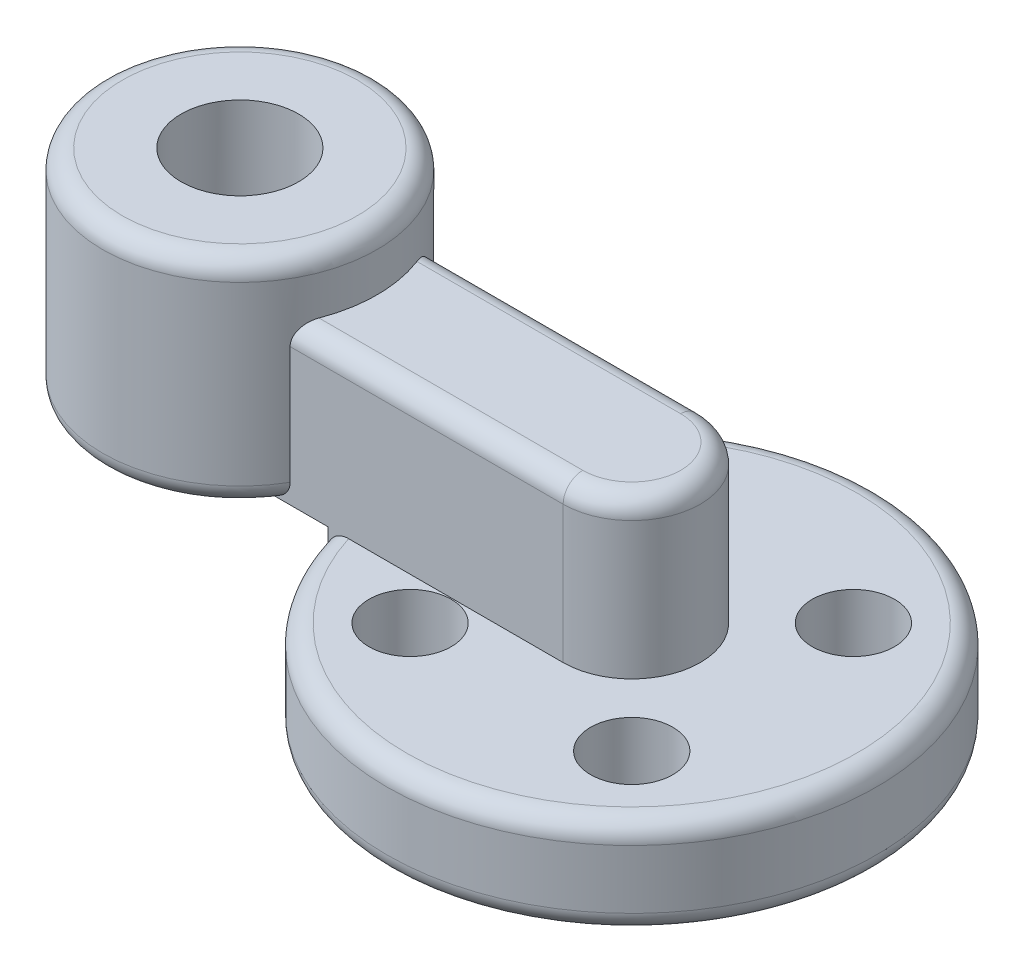
ISO-10303-21;
HEADER;
FILE_DESCRIPTION(('STEP AP214'),'2;1');
FILE_NAME('part.step','',(''),(''),'','','');
FILE_SCHEMA(('AUTOMOTIVE_DESIGN { 1 0 10303 214 1 1 1 1 }'));
ENDSEC;
DATA;
#1=APPLICATION_CONTEXT('core data for automotive mechanical design processes');
#2=APPLICATION_PROTOCOL_DEFINITION('international standard','automotive_design',2000,#1);
#3=PRODUCT_CONTEXT('',#1,'mechanical');
#4=PRODUCT('Part','Part','',(#3));
#5=PRODUCT_RELATED_PRODUCT_CATEGORY('part','',(#4));
#6=PRODUCT_DEFINITION_FORMATION('','',#4);
#7=PRODUCT_DEFINITION_CONTEXT('part definition',#1,'design');
#8=PRODUCT_DEFINITION('design','',#6,#7);
#9=PRODUCT_DEFINITION_SHAPE('','',#8);
#10=(LENGTH_UNIT() NAMED_UNIT(*) SI_UNIT(.MILLI.,.METRE.));
#11=(NAMED_UNIT(*) PLANE_ANGLE_UNIT() SI_UNIT($,.RADIAN.));
#12=(NAMED_UNIT(*) SI_UNIT($,.STERADIAN.) SOLID_ANGLE_UNIT());
#13=UNCERTAINTY_MEASURE_WITH_UNIT(LENGTH_MEASURE(1.E-05),#10,'distance_accuracy_value','');
#14=(GEOMETRIC_REPRESENTATION_CONTEXT(3) GLOBAL_UNCERTAINTY_ASSIGNED_CONTEXT((#13)) GLOBAL_UNIT_ASSIGNED_CONTEXT((#10,
#11,#12)) REPRESENTATION_CONTEXT('',''));
#15=CARTESIAN_POINT('',(0.,0.,0.));
#16=DIRECTION('',(0.,0.,1.));
#17=DIRECTION('',(1.,0.,0.));
#18=AXIS2_PLACEMENT_3D('',#15,#16,#17);
#19=CARTESIAN_POINT('',(-20.,0.,0.));
#20=DIRECTION('',(0.,1.,0.));
#21=DIRECTION('',(0.,0.,1.));
#22=AXIS2_PLACEMENT_3D('',#19,#20,#21);
#23=CYLINDRICAL_SURFACE('',#22,3.);
#24=CARTESIAN_POINT('',(-20.,16.,0.));
#25=DIRECTION('',(0.,1.,0.));
#26=DIRECTION('',(0.,0.,1.));
#27=AXIS2_PLACEMENT_3D('',#24,#25,#26);
#28=CIRCLE('',#27,3.);
#29=CARTESIAN_POINT('',(-20.,16.,3.));
#30=VERTEX_POINT('',#29);
#31=EDGE_CURVE('E191',#30,#30,#28,.T.);
#32=ORIENTED_EDGE('',*,*,#31,.T.);
#33=EDGE_LOOP('',(#32));
#34=FACE_BOUND('',#33,.T.);
#35=CARTESIAN_POINT('',(-20.,11.,0.));
#36=DIRECTION('',(0.,-1.,0.));
#37=DIRECTION('',(0.,0.,-1.));
#38=AXIS2_PLACEMENT_3D('',#35,#36,#37);
#39=CIRCLE('',#38,3.);
#40=CARTESIAN_POINT('',(-20.,11.,-3.));
#41=VERTEX_POINT('',#40);
#42=EDGE_CURVE('E187',#41,#41,#39,.F.);
#43=ORIENTED_EDGE('',*,*,#42,.F.);
#44=EDGE_LOOP('',(#43));
#45=FACE_BOUND('',#44,.T.);
#46=ADVANCED_FACE('F44',(#34,#45),#23,.F.);
#47=CARTESIAN_POINT('',(5.65685424949235,0.,-5.65685424949241));
#48=DIRECTION('',(0.,1.,0.));
#49=DIRECTION('',(0.,0.,1.));
#50=AXIS2_PLACEMENT_3D('',#47,#48,#49);
#51=CYLINDRICAL_SURFACE('',#50,1.1);
#52=CARTESIAN_POINT('',(5.65685424949235,0.,-5.65685424949241));
#53=DIRECTION('',(0.,1.,0.));
#54=DIRECTION('',(-1.,0.,0.));
#55=AXIS2_PLACEMENT_3D('',#52,#53,#54);
#56=CIRCLE('',#55,1.1);
#57=CARTESIAN_POINT('',(4.55685424949235,0.,-5.6568542494924));
#58=VERTEX_POINT('',#57);
#59=EDGE_CURVE('E167',#58,#58,#56,.T.);
#60=ORIENTED_EDGE('',*,*,#59,.F.);
#61=EDGE_LOOP('',(#60));
#62=FACE_BOUND('',#61,.T.);
#63=CARTESIAN_POINT('',(5.65685424949235,2.,-5.65685424949241));
#64=DIRECTION('',(0.,1.,0.));
#65=DIRECTION('',(0.,0.,1.));
#66=AXIS2_PLACEMENT_3D('',#63,#64,#65);
#67=CIRCLE('',#66,1.1);
#68=CARTESIAN_POINT('',(5.65685424949235,2.,-4.55685424949241));
#69=VERTEX_POINT('',#68);
#70=EDGE_CURVE('E178',#69,#69,#67,.F.);
#71=ORIENTED_EDGE('',*,*,#70,.F.);
#72=EDGE_LOOP('',(#71));
#73=FACE_BOUND('',#72,.T.);
#74=ADVANCED_FACE('F306',(#62,#73),#51,.F.);
#75=CARTESIAN_POINT('',(5.65685424949235,0.,5.65685424949241));
#76=DIRECTION('',(0.,1.,0.));
#77=DIRECTION('',(0.,0.,1.));
#78=AXIS2_PLACEMENT_3D('',#75,#76,#77);
#79=CYLINDRICAL_SURFACE('',#78,1.1);
#80=CARTESIAN_POINT('',(5.65685424949235,0.,5.65685424949241));
#81=DIRECTION('',(0.,1.,0.));
#82=DIRECTION('',(0.,0.,-1.));
#83=AXIS2_PLACEMENT_3D('',#80,#81,#82);
#84=CIRCLE('',#83,1.1);
#85=CARTESIAN_POINT('',(5.65685424949235,0.,4.55685424949241));
#86=VERTEX_POINT('',#85);
#87=EDGE_CURVE('E383',#86,#86,#84,.T.);
#88=ORIENTED_EDGE('',*,*,#87,.F.);
#89=EDGE_LOOP('',(#88));
#90=FACE_BOUND('',#89,.T.);
#91=CARTESIAN_POINT('',(5.65685424949235,2.,5.65685424949241));
#92=DIRECTION('',(0.,1.,0.));
#93=DIRECTION('',(0.,0.,1.));
#94=AXIS2_PLACEMENT_3D('',#91,#92,#93);
#95=CIRCLE('',#94,1.1);
#96=CARTESIAN_POINT('',(5.65685424949235,2.,6.75685424949241));
#97=VERTEX_POINT('',#96);
#98=EDGE_CURVE('E173',#97,#97,#95,.F.);
#99=ORIENTED_EDGE('',*,*,#98,.F.);
#100=EDGE_LOOP('',(#99));
#101=FACE_BOUND('',#100,.T.);
#102=ADVANCED_FACE('F311',(#90,#101),#79,.F.);
#103=CARTESIAN_POINT('',(-5.65685424949239,0.,5.65685424949237));
#104=DIRECTION('',(0.,1.,0.));
#105=DIRECTION('',(0.,0.,1.));
#106=AXIS2_PLACEMENT_3D('',#103,#104,#105);
#107=CYLINDRICAL_SURFACE('',#106,1.1);
#108=CARTESIAN_POINT('',(-5.65685424949239,0.,5.65685424949237));
#109=DIRECTION('',(0.,1.,0.));
#110=DIRECTION('',(1.,0.,0.));
#111=AXIS2_PLACEMENT_3D('',#108,#109,#110);
#112=CIRCLE('',#111,1.1);
#113=CARTESIAN_POINT('',(-4.55685424949239,0.,5.65685424949237));
#114=VERTEX_POINT('',#113);
#115=EDGE_CURVE('E378',#114,#114,#112,.T.);
#116=ORIENTED_EDGE('',*,*,#115,.F.);
#117=EDGE_LOOP('',(#116));
#118=FACE_BOUND('',#117,.T.);
#119=CARTESIAN_POINT('',(-5.65685424949239,2.,5.65685424949237));
#120=DIRECTION('',(0.,1.,0.));
#121=DIRECTION('',(0.,0.,1.));
#122=AXIS2_PLACEMENT_3D('',#119,#120,#121);
#123=CIRCLE('',#122,1.1);
#124=CARTESIAN_POINT('',(-5.65685424949239,2.,6.75685424949237));
#125=VERTEX_POINT('',#124);
#126=EDGE_CURVE('E169',#125,#125,#123,.F.);
#127=ORIENTED_EDGE('',*,*,#126,.F.);
#128=EDGE_LOOP('',(#127));
#129=FACE_BOUND('',#128,.T.);
#130=ADVANCED_FACE('F458',(#118,#129),#107,.F.);
#131=CARTESIAN_POINT('',(-5.65685424949235,0.,-5.65685424949241));
#132=DIRECTION('',(0.,1.,0.));
#133=DIRECTION('',(0.,0.,1.));
#134=AXIS2_PLACEMENT_3D('',#131,#132,#133);
#135=CYLINDRICAL_SURFACE('',#134,1.1);
#136=CARTESIAN_POINT('',(-5.65685424949235,0.,-5.65685424949241));
#137=DIRECTION('',(0.,1.,0.));
#138=DIRECTION('',(0.,0.,1.));
#139=AXIS2_PLACEMENT_3D('',#136,#137,#138);
#140=CIRCLE('',#139,1.1);
#141=CARTESIAN_POINT('',(-5.65685424949235,0.,-4.55685424949241));
#142=VERTEX_POINT('',#141);
#143=EDGE_CURVE('E382',#142,#142,#140,.T.);
#144=ORIENTED_EDGE('',*,*,#143,.F.);
#145=EDGE_LOOP('',(#144));
#146=FACE_BOUND('',#145,.T.);
#147=CARTESIAN_POINT('',(-5.65685424949235,2.,-5.65685424949241));
#148=DIRECTION('',(0.,1.,0.));
#149=DIRECTION('',(0.,0.,1.));
#150=AXIS2_PLACEMENT_3D('',#147,#148,#149);
#151=CIRCLE('',#150,1.1);
#152=CARTESIAN_POINT('',(-5.65685424949235,2.,-4.55685424949241));
#153=VERTEX_POINT('',#152);
#154=EDGE_CURVE('E163',#153,#153,#151,.F.);
#155=ORIENTED_EDGE('',*,*,#154,.F.);
#156=EDGE_LOOP('',(#155));
#157=FACE_BOUND('',#156,.T.);
#158=ADVANCED_FACE('F453',(#146,#157),#135,.F.);
#159=CARTESIAN_POINT('',(0.,5.,0.));
#160=DIRECTION('',(0.,-1.,0.));
#161=DIRECTION('',(0.,0.,-1.));
#162=AXIS2_PLACEMENT_3D('',#159,#160,#161);
#163=CYLINDRICAL_SURFACE('',#162,12.5);
#164=CARTESIAN_POINT('',(0.,1.,0.));
#165=DIRECTION('',(0.,1.,0.));
#166=DIRECTION('',(0.,0.,1.));
#167=AXIS2_PLACEMENT_3D('',#164,#165,#166);
#168=CIRCLE('',#167,12.5);
#169=CARTESIAN_POINT('',(0.,1.,12.5));
#170=VERTEX_POINT('',#169);
#171=EDGE_CURVE('E208',#170,#170,#168,.T.);
#172=ORIENTED_EDGE('',*,*,#171,.T.);
#173=EDGE_LOOP('',(#172));
#174=FACE_BOUND('',#173,.T.);
#175=CARTESIAN_POINT('',(0.,5.,0.));
#176=DIRECTION('',(0.,1.,0.));
#177=DIRECTION('',(0.,0.,1.));
#178=AXIS2_PLACEMENT_3D('',#175,#176,#177);
#179=CIRCLE('',#178,12.5);
#180=CARTESIAN_POINT('',(-12.,5.,-3.5));
#181=VERTEX_POINT('',#180);
#182=CARTESIAN_POINT('',(-12.,5.,3.5));
#183=VERTEX_POINT('',#182);
#184=EDGE_CURVE('E127',#181,#183,#179,.T.);
#185=ORIENTED_EDGE('',*,*,#184,.F.);
#186=DIRECTION('',(0.,-1.,0.));
#187=VECTOR('',#186,1.);
#188=CARTESIAN_POINT('',(-12.,5.,-3.5));
#189=LINE('',#188,#187);
#190=CARTESIAN_POINT('',(-12.,4.,-3.5));
#191=VERTEX_POINT('',#190);
#192=EDGE_CURVE('E66',#181,#191,#189,.T.);
#193=ORIENTED_EDGE('',*,*,#192,.T.);
#194=CARTESIAN_POINT('',(0.,4.,0.));
#195=DIRECTION('',(0.,1.,0.));
#196=DIRECTION('',(0.,0.,1.));
#197=AXIS2_PLACEMENT_3D('',#194,#195,#196);
#198=CIRCLE('',#197,12.5);
#199=CARTESIAN_POINT('',(-12.,4.,3.5));
#200=VERTEX_POINT('',#199);
#201=EDGE_CURVE('E130',#191,#200,#198,.F.);
#202=ORIENTED_EDGE('',*,*,#201,.T.);
#203=DIRECTION('',(0.,-1.,0.));
#204=VECTOR('',#203,1.);
#205=CARTESIAN_POINT('',(-12.,4.,3.5));
#206=LINE('',#205,#204);
#207=EDGE_CURVE('E123',#200,#183,#206,.F.);
#208=ORIENTED_EDGE('',*,*,#207,.T.);
#209=EDGE_LOOP('',(#185,#193,#202,#208));
#210=FACE_BOUND('',#209,.T.);
#211=ADVANCED_FACE('F125',(#174,#210),#163,.T.);
#212=CARTESIAN_POINT('',(0.,5.,0.));
#213=DIRECTION('',(0.,1.,0.));
#214=DIRECTION('',(0.,0.,1.));
#215=AXIS2_PLACEMENT_3D('',#212,#213,#214);
#216=PLANE('',#215);
#217=CARTESIAN_POINT('',(5.65685424949243,5.,-5.65685424949233));
#218=DIRECTION('',(0.,1.,0.));
#219=DIRECTION('',(-1.,0.,0.));
#220=AXIS2_PLACEMENT_3D('',#217,#218,#219);
#221=CIRCLE('',#220,2.1);
#222=CARTESIAN_POINT('',(3.55685424949243,5.,-5.65685424949234));
#223=VERTEX_POINT('',#222);
#224=EDGE_CURVE('E353',#223,#223,#221,.T.);
#225=ORIENTED_EDGE('',*,*,#224,.F.);
#226=EDGE_LOOP('',(#225));
#227=FACE_BOUND('',#226,.T.);
#228=CARTESIAN_POINT('',(5.65685424949235,5.,5.65685424949241));
#229=DIRECTION('',(0.,1.,0.));
#230=DIRECTION('',(0.,0.,-1.));
#231=AXIS2_PLACEMENT_3D('',#228,#229,#230);
#232=CIRCLE('',#231,2.1);
#233=CARTESIAN_POINT('',(5.65685424949235,5.,3.55685424949241));
#234=VERTEX_POINT('',#233);
#235=EDGE_CURVE('E361',#234,#234,#232,.T.);
#236=ORIENTED_EDGE('',*,*,#235,.F.);
#237=EDGE_LOOP('',(#236));
#238=FACE_BOUND('',#237,.T.);
#239=CARTESIAN_POINT('',(-5.65685424949247,5.,5.65685424949229));
#240=DIRECTION('',(0.,1.,0.));
#241=DIRECTION('',(1.,0.,0.));
#242=AXIS2_PLACEMENT_3D('',#239,#240,#241);
#243=CIRCLE('',#242,2.1);
#244=CARTESIAN_POINT('',(-3.55685424949247,5.,5.65685424949231));
#245=VERTEX_POINT('',#244);
#246=EDGE_CURVE('E349',#245,#245,#243,.T.);
#247=ORIENTED_EDGE('',*,*,#246,.F.);
#248=EDGE_LOOP('',(#247));
#249=FACE_BOUND('',#248,.T.);
#250=CARTESIAN_POINT('',(-5.65685424949235,5.,-5.65685424949241));
#251=DIRECTION('',(0.,1.,0.));
#252=DIRECTION('',(0.,0.,1.));
#253=AXIS2_PLACEMENT_3D('',#250,#251,#252);
#254=CIRCLE('',#253,2.1);
#255=CARTESIAN_POINT('',(-5.65685424949235,5.,-3.55685424949241));
#256=VERTEX_POINT('',#255);
#257=EDGE_CURVE('E182',#256,#256,#254,.T.);
#258=ORIENTED_EDGE('',*,*,#257,.F.);
#259=EDGE_LOOP('',(#258));
#260=FACE_BOUND('',#259,.T.);
#261=DIRECTION('',(1.,0.,0.));
#262=VECTOR('',#261,1.);
#263=CARTESIAN_POINT('',(0.,5.,3.5));
#264=LINE('',#263,#262);
#265=CARTESIAN_POINT('',(-10.9544511501033,5.,3.5));
#266=VERTEX_POINT('',#265);
#267=CARTESIAN_POINT('',(0.,5.,3.5));
#268=VERTEX_POINT('',#267);
#269=EDGE_CURVE('E150',#266,#268,#264,.T.);
#270=ORIENTED_EDGE('',*,*,#269,.F.);
#271=CARTESIAN_POINT('',(0.,5.,0.));
#272=DIRECTION('',(0.,1.,0.));
#273=DIRECTION('',(0.,0.,1.));
#274=AXIS2_PLACEMENT_3D('',#271,#272,#273);
#275=CIRCLE('',#274,11.5);
#276=CARTESIAN_POINT('',(-10.9544511501033,5.,-3.5));
#277=VERTEX_POINT('',#276);
#278=EDGE_CURVE('E134',#266,#277,#275,.T.);
#279=ORIENTED_EDGE('',*,*,#278,.T.);
#280=DIRECTION('',(-1.,0.,0.));
#281=VECTOR('',#280,1.);
#282=CARTESIAN_POINT('',(0.,5.,-3.5));
#283=LINE('',#282,#281);
#284=CARTESIAN_POINT('',(0.,5.,-3.5));
#285=VERTEX_POINT('',#284);
#286=EDGE_CURVE('E148',#285,#277,#283,.T.);
#287=ORIENTED_EDGE('',*,*,#286,.F.);
#288=CARTESIAN_POINT('',(0.,5.,0.));
#289=DIRECTION('',(0.,1.,0.));
#290=DIRECTION('',(0.,0.,1.));
#291=AXIS2_PLACEMENT_3D('',#288,#289,#290);
#292=CIRCLE('',#291,3.5);
#293=EDGE_CURVE('E393',#268,#285,#292,.T.);
#294=ORIENTED_EDGE('',*,*,#293,.F.);
#295=EDGE_LOOP('',(#270,#279,#287,#294));
#296=FACE_BOUND('',#295,.T.);
#297=ADVANCED_FACE('F410',(#227,#238,#249,#260,#296),#216,.T.);
#298=CARTESIAN_POINT('',(0.,0.,0.));
#299=DIRECTION('',(0.,1.,0.));
#300=DIRECTION('',(0.,0.,1.));
#301=AXIS2_PLACEMENT_3D('',#298,#299,#300);
#302=PLANE('',#301);
#303=CARTESIAN_POINT('',(0.,0.,0.));
#304=DIRECTION('',(0.,1.,0.));
#305=DIRECTION('',(0.,0.,1.));
#306=AXIS2_PLACEMENT_3D('',#303,#304,#305);
#307=CIRCLE('',#306,11.5);
#308=CARTESIAN_POINT('',(0.,0.,11.5));
#309=VERTEX_POINT('',#308);
#310=EDGE_CURVE('E212',#309,#309,#307,.F.);
#311=ORIENTED_EDGE('',*,*,#310,.T.);
#312=EDGE_LOOP('',(#311));
#313=FACE_BOUND('',#312,.T.);
#314=ORIENTED_EDGE('',*,*,#115,.T.);
#315=EDGE_LOOP('',(#314));
#316=FACE_BOUND('',#315,.T.);
#317=ORIENTED_EDGE('',*,*,#87,.T.);
#318=EDGE_LOOP('',(#317));
#319=FACE_BOUND('',#318,.T.);
#320=ORIENTED_EDGE('',*,*,#59,.T.);
#321=EDGE_LOOP('',(#320));
#322=FACE_BOUND('',#321,.T.);
#323=ORIENTED_EDGE('',*,*,#143,.T.);
#324=EDGE_LOOP('',(#323));
#325=FACE_BOUND('',#324,.T.);
#326=ADVANCED_FACE('F448',(#313,#316,#319,#322,#325),#302,.F.);
#327=CARTESIAN_POINT('',(0.,5.,0.));
#328=DIRECTION('',(0.,1.,0.));
#329=DIRECTION('',(0.,0.,1.));
#330=AXIS2_PLACEMENT_3D('',#327,#328,#329);
#331=PLANE('',#330);
#332=CARTESIAN_POINT('',(-20.,5.,0.));
#333=DIRECTION('',(0.,-1.,0.));
#334=DIRECTION('',(0.,0.,-1.));
#335=AXIS2_PLACEMENT_3D('',#332,#333,#334);
#336=CIRCLE('',#335,5.25);
#337=CARTESIAN_POINT('',(-20.,5.,-5.25));
#338=VERTEX_POINT('',#337);
#339=EDGE_CURVE('E332',#338,#338,#336,.T.);
#340=ORIENTED_EDGE('',*,*,#339,.F.);
#341=EDGE_LOOP('',(#340));
#342=FACE_BOUND('',#341,.T.);
#343=CARTESIAN_POINT('',(-20.,5.,0.));
#344=DIRECTION('',(0.,1.,0.));
#345=DIRECTION('',(0.,0.,1.));
#346=AXIS2_PLACEMENT_3D('',#343,#344,#345);
#347=CIRCLE('',#346,6.);
#348=CARTESIAN_POINT('',(-15.1266028275955,5.,3.5));
#349=VERTEX_POINT('',#348);
#350=CARTESIAN_POINT('',(-15.1266028275955,5.,-3.5));
#351=VERTEX_POINT('',#350);
#352=EDGE_CURVE('E216',#349,#351,#347,.F.);
#353=ORIENTED_EDGE('',*,*,#352,.T.);
#354=EDGE_CURVE('E152',#181,#351,#283,.T.);
#355=ORIENTED_EDGE('',*,*,#354,.F.);
#356=ORIENTED_EDGE('',*,*,#184,.T.);
#357=EDGE_CURVE('E137',#349,#183,#264,.T.);
#358=ORIENTED_EDGE('',*,*,#357,.F.);
#359=EDGE_LOOP('',(#353,#355,#356,#358));
#360=FACE_BOUND('',#359,.T.);
#361=ADVANCED_FACE('F151',(#342,#360),#331,.F.);
#362=CARTESIAN_POINT('',(0.,13.,0.));
#363=DIRECTION('',(0.,-1.,0.));
#364=DIRECTION('',(0.,0.,-1.));
#365=AXIS2_PLACEMENT_3D('',#362,#363,#364);
#366=CYLINDRICAL_SURFACE('',#365,3.5);
#367=DIRECTION('',(0.,-1.,0.));
#368=VECTOR('',#367,1.);
#369=CARTESIAN_POINT('',(0.,13.,-3.5));
#370=LINE('',#369,#368);
#371=CARTESIAN_POINT('',(0.,12.,-3.5));
#372=VERTEX_POINT('',#371);
#373=EDGE_CURVE('E154',#372,#285,#370,.T.);
#374=ORIENTED_EDGE('',*,*,#373,.F.);
#375=CARTESIAN_POINT('',(0.,12.,0.));
#376=DIRECTION('',(0.,1.,0.));
#377=DIRECTION('',(0.,0.,1.));
#378=AXIS2_PLACEMENT_3D('',#375,#376,#377);
#379=CIRCLE('',#378,3.5);
#380=CARTESIAN_POINT('',(0.,12.,3.5));
#381=VERTEX_POINT('',#380);
#382=EDGE_CURVE('E205',#372,#381,#379,.F.);
#383=ORIENTED_EDGE('',*,*,#382,.T.);
#384=DIRECTION('',(0.,-1.,0.));
#385=VECTOR('',#384,1.);
#386=CARTESIAN_POINT('',(0.,13.,3.5));
#387=LINE('',#386,#385);
#388=EDGE_CURVE('E147',#381,#268,#387,.T.);
#389=ORIENTED_EDGE('',*,*,#388,.T.);
#390=ORIENTED_EDGE('',*,*,#293,.T.);
#391=EDGE_LOOP('',(#374,#383,#389,#390));
#392=FACE_BOUND('',#391,.T.);
#393=ADVANCED_FACE('F404',(#392),#366,.T.);
#394=CARTESIAN_POINT('',(0.,13.,-3.5));
#395=DIRECTION('',(0.,0.,1.));
#396=DIRECTION('',(1.,0.,0.));
#397=AXIS2_PLACEMENT_3D('',#394,#395,#396);
#398=PLANE('',#397);
#399=DIRECTION('',(0.,1.,0.));
#400=VECTOR('',#399,1.);
#401=CARTESIAN_POINT('',(-13.9378221735089,-14.7989898732233,-3.5));
#402=LINE('',#401,#400);
#403=CARTESIAN_POINT('',(-13.9378221735089,6.,-3.5));
#404=VERTEX_POINT('',#403);
#405=CARTESIAN_POINT('',(-13.9378221735089,12.,-3.5));
#406=VERTEX_POINT('',#405);
#407=EDGE_CURVE('E345',#404,#406,#402,.T.);
#408=ORIENTED_EDGE('',*,*,#407,.T.);
#409=DIRECTION('',(-1.,0.,0.));
#410=VECTOR('',#409,1.);
#411=CARTESIAN_POINT('',(0.,12.,-3.5));
#412=LINE('',#411,#410);
#413=EDGE_CURVE('E202',#406,#372,#412,.F.);
#414=ORIENTED_EDGE('',*,*,#413,.T.);
#415=ORIENTED_EDGE('',*,*,#373,.T.);
#416=ORIENTED_EDGE('',*,*,#286,.T.);
#417=CARTESIAN_POINT('',(-10.9544511501033,5.,-3.5));
#418=CARTESIAN_POINT('',(-11.015393050138,5.0000399408867,-3.5));
#419=CARTESIAN_POINT('',(-11.076344548793,4.9949468270869,-3.5));
#420=CARTESIAN_POINT('',(-11.1966066919985,4.97471355316197,-3.5));
#421=CARTESIAN_POINT('',(-11.2559159395824,4.9595650974475,-3.5));
#422=CARTESIAN_POINT('',(-11.3711928553703,4.91941801522329,-3.5));
#423=CARTESIAN_POINT('',(-11.4271566378325,4.89440818128597,-3.5));
#424=CARTESIAN_POINT('',(-11.5338983294762,4.83510902699287,-3.5));
#425=CARTESIAN_POINT('',(-11.5846797043356,4.80082596475888,-3.5));
#426=CARTESIAN_POINT('',(-11.6781199261024,4.72486332981569,-3.5));
#427=CARTESIAN_POINT('',(-11.720960659494,4.6834077647015,-3.5));
#428=CARTESIAN_POINT('',(-11.7987026586936,4.59359017426443,-3.5));
#429=CARTESIAN_POINT('',(-11.8336031706204,4.54522749385707,-3.5));
#430=CARTESIAN_POINT('',(-11.8928642662983,4.44522945932957,-3.5));
#431=CARTESIAN_POINT('',(-11.9176129216732,4.39382364777041,-3.5));
#432=CARTESIAN_POINT('',(-11.9577460771427,4.28750740931171,-3.5));
#433=CARTESIAN_POINT('',(-11.9731419082727,4.2326013125527,-3.5));
#434=CARTESIAN_POINT('',(-11.9890454545984,4.1476596616631,-3.5));
#435=CARTESIAN_POINT('',(-11.9931518201958,4.11825595891651,-3.5));
#436=CARTESIAN_POINT('',(-11.9986274860902,4.05923985431598,-3.5));
#437=CARTESIAN_POINT('',(-12.0000009287981,4.02962783669578,-3.5));
#438=CARTESIAN_POINT('',(-12.,4.,-3.5));
#439=B_SPLINE_CURVE_WITH_KNOTS('',3,(#417,#418,#419,#420,#421,#422,#423,#424,#425,#426,#427,
#428,#429,#430,#431,#432,#433,#434,#435,#436,#437,#438),.UNSPECIFIED.,.F.,.F.,(4,2,2,2,2,2,2,2,
2,2,4),(0.,0.182630412325393,0.365411681082441,0.548401281749542,0.731267697017635,
0.909210377634625,1.08716994590845,1.25749174755954,1.42760678906364,1.51656229698949,
1.60538286813315),.UNSPECIFIED.);
#440=EDGE_CURVE('E59',#277,#191,#439,.T.);
#441=ORIENTED_EDGE('',*,*,#440,.T.);
#442=ORIENTED_EDGE('',*,*,#192,.F.);
#443=ORIENTED_EDGE('',*,*,#354,.T.);
#444=CARTESIAN_POINT('',(-15.1266028275955,5.,-3.5));
#445=CARTESIAN_POINT('',(-15.0418695435277,4.99995885196361,-3.5));
#446=CARTESIAN_POINT('',(-14.9568490859977,5.00711164838328,-3.5));
#447=CARTESIAN_POINT('',(-14.789078518426,5.03653608852522,-3.5));
#448=CARTESIAN_POINT('',(-14.7063413676261,5.05888063823222,-3.5));
#449=CARTESIAN_POINT('',(-14.565517960192,5.11235041501861,-3.5));
#450=CARTESIAN_POINT('',(-14.5061928421162,5.14019870681064,-3.5));
#451=CARTESIAN_POINT('',(-14.3929916845033,5.20523511688822,-3.5));
#452=CARTESIAN_POINT('',(-14.3391050513693,5.24240456607619,-3.5));
#453=CARTESIAN_POINT('',(-14.2383965528382,5.32615162541478,-3.5));
#454=CARTESIAN_POINT('',(-14.1916351313437,5.37280265201955,-3.5));
#455=CARTESIAN_POINT('',(-14.1081191971419,5.47443100056455,-3.5));
#456=CARTESIAN_POINT('',(-14.0713631276109,5.52940702506845,-3.5));
#457=CARTESIAN_POINT('',(-14.0144097207178,5.63787870765021,-3.5));
#458=CARTESIAN_POINT('',(-13.9926356279477,5.69054933147541,-3.5));
#459=CARTESIAN_POINT('',(-13.9595487191807,5.79901418946915,-3.5));
#460=CARTESIAN_POINT('',(-13.9482072205015,5.85479940936312,-3.5));
#461=CARTESIAN_POINT('',(-13.940873128798,5.92583648047872,-3.5));
#462=CARTESIAN_POINT('',(-13.9397288607602,5.94065703053905,-3.5));
#463=CARTESIAN_POINT('',(-13.9382046544085,5.97031601721967,-3.5));
#464=CARTESIAN_POINT('',(-13.9378236180372,5.9851543973677,-3.5));
#465=CARTESIAN_POINT('',(-13.9378221735089,6.,-3.5));
#466=B_SPLINE_CURVE_WITH_KNOTS('',3,(#444,#445,#446,#447,#448,#449,#450,#451,#452,#453,#454,
#455,#456,#457,#458,#459,#460,#461,#462,#463,#464,#465),.UNSPECIFIED.,.F.,.F.,(4,2,2,2,2,2,2,2,
2,2,4),(0.,0.254371664083559,0.509972768449432,0.70577970901293,0.901197562277586,
1.09819051312194,1.29515279449686,1.46518932294011,1.63475695464748,1.67933863592511,
1.72385613156152),.UNSPECIFIED.);
#467=EDGE_CURVE('E242',#351,#404,#466,.T.);
#468=ORIENTED_EDGE('',*,*,#467,.T.);
#469=EDGE_LOOP('',(#408,#414,#415,#416,#441,#442,#443,#468));
#470=FACE_BOUND('',#469,.T.);
#471=ADVANCED_FACE('F413',(#470),#398,.F.);
#472=CARTESIAN_POINT('',(0.,13.,3.5));
#473=DIRECTION('',(0.,0.,-1.));
#474=DIRECTION('',(-1.,0.,0.));
#475=AXIS2_PLACEMENT_3D('',#472,#473,#474);
#476=PLANE('',#475);
#477=ORIENTED_EDGE('',*,*,#388,.F.);
#478=DIRECTION('',(1.,0.,0.));
#479=VECTOR('',#478,1.);
#480=CARTESIAN_POINT('',(-13.9378221735089,12.,3.5));
#481=LINE('',#480,#479);
#482=CARTESIAN_POINT('',(-13.9378221735089,12.,3.5));
#483=VERTEX_POINT('',#482);
#484=EDGE_CURVE('E226',#381,#483,#481,.F.);
#485=ORIENTED_EDGE('',*,*,#484,.T.);
#486=DIRECTION('',(0.,1.,0.));
#487=VECTOR('',#486,1.);
#488=CARTESIAN_POINT('',(-13.9378221735089,-14.7989898732233,3.5));
#489=LINE('',#488,#487);
#490=CARTESIAN_POINT('',(-13.9378221735089,6.,3.5));
#491=VERTEX_POINT('',#490);
#492=EDGE_CURVE('E342',#483,#491,#489,.F.);
#493=ORIENTED_EDGE('',*,*,#492,.T.);
#494=CARTESIAN_POINT('',(-13.9378221735089,6.,3.5));
#495=CARTESIAN_POINT('',(-13.9378207222453,5.9746811809769,3.5));
#496=CARTESIAN_POINT('',(-13.9389333256724,5.94937546223626,3.5));
#497=CARTESIAN_POINT('',(-13.9433607837191,5.89896467870939,3.5));
#498=CARTESIAN_POINT('',(-13.9466749978766,5.87385955771688,3.5));
#499=CARTESIAN_POINT('',(-13.9598397705174,5.79932511142255,3.5));
#500=CARTESIAN_POINT('',(-13.9729130392724,5.75042913116539,3.5));
#501=CARTESIAN_POINT('',(-14.0070421061269,5.65559344609523,3.5));
#502=CARTESIAN_POINT('',(-14.0280925208463,5.60965177197049,3.5));
#503=CARTESIAN_POINT('',(-14.077288774548,5.52171382905423,3.5));
#504=CARTESIAN_POINT('',(-14.105439971157,5.47972057238226,3.5));
#505=CARTESIAN_POINT('',(-14.169200735412,5.3986974926744,3.5));
#506=CARTESIAN_POINT('',(-14.2050921637698,5.35989053198545,3.5));
#507=CARTESIAN_POINT('',(-14.2822163376092,5.28805654618852,3.5));
#508=CARTESIAN_POINT('',(-14.3234493171366,5.25502977449469,3.5));
#509=CARTESIAN_POINT('',(-14.4154878310552,5.19127732378361,3.5));
#510=CARTESIAN_POINT('',(-14.4668459573969,5.16135110354909,3.5));
#511=CARTESIAN_POINT('',(-14.5733963660618,5.10918762071228,3.5));
#512=CARTESIAN_POINT('',(-14.6285953372103,5.08696419639254,3.5));
#513=CARTESIAN_POINT('',(-14.7562436192449,5.045318619124,3.5));
#514=CARTESIAN_POINT('',(-14.8294268786372,5.02815164592744,3.5));
#515=CARTESIAN_POINT('',(-14.9773336966712,5.00550352009543,3.5));
#516=CARTESIAN_POINT('',(-15.0520508521329,4.99998102715957,3.5));
#517=CARTESIAN_POINT('',(-15.1266028275955,5.,3.5));
#518=B_SPLINE_CURVE_WITH_KNOTS('',3,(#494,#495,#496,#497,#498,#499,#500,#501,#502,#503,#504,
#505,#506,#507,#508,#509,#510,#511,#512,#513,#514,#515,#516,#517),.UNSPECIFIED.,.F.,.F.,(4,2,2,
2,2,2,2,2,2,2,2,4),(0.,0.0759064625327166,0.151790853071843,0.302827023476806,0.45376144805193,
0.604810096937945,0.762755692247632,0.920708210450552,1.09834156323315,1.27629240491548,
1.50081389198878,1.72453693014909),.UNSPECIFIED.);
#519=EDGE_CURVE('E142',#491,#349,#518,.T.);
#520=ORIENTED_EDGE('',*,*,#519,.T.);
#521=ORIENTED_EDGE('',*,*,#357,.T.);
#522=ORIENTED_EDGE('',*,*,#207,.F.);
#523=CARTESIAN_POINT('',(-12.,4.,3.5));
#524=CARTESIAN_POINT('',(-12.000000356195,4.02730045156718,3.5));
#525=CARTESIAN_POINT('',(-11.9988346684209,4.05458754889781,3.5));
#526=CARTESIAN_POINT('',(-11.9941879491627,4.10896053855144,3.5));
#527=CARTESIAN_POINT('',(-11.990707201814,4.13604645515361,3.5));
#528=CARTESIAN_POINT('',(-11.9768419609349,4.2166060829984,3.5));
#529=CARTESIAN_POINT('',(-11.9630342586204,4.26953038277122,3.5));
#530=CARTESIAN_POINT('',(-11.9267569757935,4.37229161479637,3.5));
#531=CARTESIAN_POINT('',(-11.9042863848587,4.42212818611467,3.5));
#532=CARTESIAN_POINT('',(-11.8514249067011,4.51741255300094,3.5));
#533=CARTESIAN_POINT('',(-11.8210330683908,4.56285982065571,3.5));
#534=CARTESIAN_POINT('',(-11.752736669703,4.64890515692519,3.5));
#535=CARTESIAN_POINT('',(-11.7147186885478,4.68941304067657,3.5));
#536=CARTESIAN_POINT('',(-11.6326413757178,4.76375930812283,3.5));
#537=CARTESIAN_POINT('',(-11.5885807220236,4.79759622838088,3.5));
#538=CARTESIAN_POINT('',(-11.4938921832258,4.85902365686832,3.5));
#539=CARTESIAN_POINT('',(-11.4430777675254,4.88632629340716,3.5));
#540=CARTESIAN_POINT('',(-11.3377146286516,4.93240026323317,3.5));
#541=CARTESIAN_POINT('',(-11.283165597974,4.95117089302958,3.5));
#542=CARTESIAN_POINT('',(-11.1829162502035,4.97698316837281,3.5));
#543=CARTESIAN_POINT('',(-11.1376171562617,4.98561618125405,3.5));
#544=CARTESIAN_POINT('',(-11.0463645379777,4.99712468731575,3.5));
#545=CARTESIAN_POINT('',(-11.0004121435315,5.00000913217756,3.5));
#546=CARTESIAN_POINT('',(-10.9544511501033,5.,3.5));
#547=B_SPLINE_CURVE_WITH_KNOTS('',3,(#523,#524,#525,#526,#527,#528,#529,#530,#531,#532,#533,
#534,#535,#536,#537,#538,#539,#540,#541,#542,#543,#544,#545,#546),.UNSPECIFIED.,.F.,.F.,(4,2,2,
2,2,2,2,2,2,2,2,4),(0.,0.0818501008696921,0.163690157838685,0.326929923599148,0.490188735093009,
0.653467157768663,0.819382956766974,0.985335112998012,1.1576244347563,1.3299279597347,
1.46791736491095,1.60569172429502),.UNSPECIFIED.);
#548=EDGE_CURVE('E11',#200,#266,#547,.T.);
#549=ORIENTED_EDGE('',*,*,#548,.T.);
#550=ORIENTED_EDGE('',*,*,#269,.T.);
#551=EDGE_LOOP('',(#477,#485,#493,#520,#521,#522,#549,#550));
#552=FACE_BOUND('',#551,.T.);
#553=ADVANCED_FACE('F139',(#552),#476,.F.);
#554=CARTESIAN_POINT('',(0.,13.,0.));
#555=DIRECTION('',(0.,1.,0.));
#556=DIRECTION('',(0.,0.,1.));
#557=AXIS2_PLACEMENT_3D('',#554,#555,#556);
#558=PLANE('',#557);
#559=CARTESIAN_POINT('',(0.,13.,0.));
#560=DIRECTION('',(0.,1.,0.));
#561=DIRECTION('',(0.,0.,1.));
#562=AXIS2_PLACEMENT_3D('',#559,#560,#561);
#563=CIRCLE('',#562,2.5);
#564=CARTESIAN_POINT('',(0.,13.,2.5));
#565=VERTEX_POINT('',#564);
#566=CARTESIAN_POINT('',(0.,13.,-2.5));
#567=VERTEX_POINT('',#566);
#568=EDGE_CURVE('E195',#565,#567,#563,.T.);
#569=ORIENTED_EDGE('',*,*,#568,.T.);
#570=DIRECTION('',(-1.,0.,0.));
#571=VECTOR('',#570,1.);
#572=CARTESIAN_POINT('',(-13.9378221735089,13.,-2.5));
#573=LINE('',#572,#571);
#574=CARTESIAN_POINT('',(-13.461651584689,13.,-2.5));
#575=VERTEX_POINT('',#574);
#576=EDGE_CURVE('E198',#567,#575,#573,.T.);
#577=ORIENTED_EDGE('',*,*,#576,.T.);
#578=CARTESIAN_POINT('',(-20.,13.,0.));
#579=DIRECTION('',(0.,1.,0.));
#580=DIRECTION('',(0.,0.,1.));
#581=AXIS2_PLACEMENT_3D('',#578,#579,#580);
#582=CIRCLE('',#581,7.);
#583=CARTESIAN_POINT('',(-13.461651584689,13.,2.5));
#584=VERTEX_POINT('',#583);
#585=EDGE_CURVE('E159',#584,#575,#582,.T.);
#586=ORIENTED_EDGE('',*,*,#585,.F.);
#587=DIRECTION('',(1.,0.,0.));
#588=VECTOR('',#587,1.);
#589=CARTESIAN_POINT('',(0.,13.,2.5));
#590=LINE('',#589,#588);
#591=EDGE_CURVE('E186',#584,#565,#590,.T.);
#592=ORIENTED_EDGE('',*,*,#591,.T.);
#593=EDGE_LOOP('',(#569,#577,#586,#592));
#594=FACE_BOUND('',#593,.T.);
#595=ADVANCED_FACE('F472',(#594),#558,.T.);
#596=CARTESIAN_POINT('',(-5.65685424949235,2.,-5.65685424949241));
#597=DIRECTION('',(0.,1.,0.));
#598=DIRECTION('',(0.,0.,1.));
#599=AXIS2_PLACEMENT_3D('',#596,#597,#598);
#600=PLANE('',#599);
#601=CARTESIAN_POINT('',(-5.65685424949235,2.,-5.65685424949241));
#602=DIRECTION('',(0.,1.,0.));
#603=DIRECTION('',(0.,0.,1.));
#604=AXIS2_PLACEMENT_3D('',#601,#602,#603);
#605=CIRCLE('',#604,2.1);
#606=CARTESIAN_POINT('',(-5.65685424949235,2.,-3.55685424949241));
#607=VERTEX_POINT('',#606);
#608=EDGE_CURVE('E168',#607,#607,#605,.T.);
#609=ORIENTED_EDGE('',*,*,#608,.T.);
#610=EDGE_LOOP('',(#609));
#611=FACE_BOUND('',#610,.T.);
#612=ORIENTED_EDGE('',*,*,#154,.T.);
#613=EDGE_LOOP('',(#612));
#614=FACE_BOUND('',#613,.T.);
#615=ADVANCED_FACE('F474',(#611,#614),#600,.T.);
#616=CARTESIAN_POINT('',(-5.65685424949235,2.,-5.65685424949241));
#617=DIRECTION('',(0.,1.,0.));
#618=DIRECTION('',(0.,0.,1.));
#619=AXIS2_PLACEMENT_3D('',#616,#617,#618);
#620=CYLINDRICAL_SURFACE('',#619,2.1);
#621=ORIENTED_EDGE('',*,*,#608,.F.);
#622=EDGE_LOOP('',(#621));
#623=FACE_BOUND('',#622,.T.);
#624=ORIENTED_EDGE('',*,*,#257,.T.);
#625=EDGE_LOOP('',(#624));
#626=FACE_BOUND('',#625,.T.);
#627=ADVANCED_FACE('F511',(#623,#626),#620,.F.);
#628=CARTESIAN_POINT('',(-5.65685424949247,2.,5.65685424949229));
#629=DIRECTION('',(0.,1.,0.));
#630=DIRECTION('',(1.,0.,0.));
#631=AXIS2_PLACEMENT_3D('',#628,#629,#630);
#632=PLANE('',#631);
#633=CARTESIAN_POINT('',(-5.65685424949247,2.,5.65685424949229));
#634=DIRECTION('',(0.,1.,0.));
#635=DIRECTION('',(1.,0.,0.));
#636=AXIS2_PLACEMENT_3D('',#633,#634,#635);
#637=CIRCLE('',#636,2.1);
#638=CARTESIAN_POINT('',(-3.55685424949247,2.,5.65685424949231));
#639=VERTEX_POINT('',#638);
#640=EDGE_CURVE('E365',#639,#639,#637,.T.);
#641=ORIENTED_EDGE('',*,*,#640,.T.);
#642=EDGE_LOOP('',(#641));
#643=FACE_BOUND('',#642,.T.);
#644=ORIENTED_EDGE('',*,*,#126,.T.);
#645=EDGE_LOOP('',(#644));
#646=FACE_BOUND('',#645,.T.);
#647=ADVANCED_FACE('F519',(#643,#646),#632,.T.);
#648=CARTESIAN_POINT('',(-5.65685424949247,2.,5.65685424949229));
#649=DIRECTION('',(0.,1.,0.));
#650=DIRECTION('',(0.,0.,1.));
#651=AXIS2_PLACEMENT_3D('',#648,#649,#650);
#652=CYLINDRICAL_SURFACE('',#651,2.1);
#653=ORIENTED_EDGE('',*,*,#640,.F.);
#654=EDGE_LOOP('',(#653));
#655=FACE_BOUND('',#654,.T.);
#656=ORIENTED_EDGE('',*,*,#246,.T.);
#657=EDGE_LOOP('',(#656));
#658=FACE_BOUND('',#657,.T.);
#659=ADVANCED_FACE('F528',(#655,#658),#652,.F.);
#660=CARTESIAN_POINT('',(5.65685424949235,2.,5.65685424949241));
#661=DIRECTION('',(0.,1.,0.));
#662=DIRECTION('',(0.,0.,-1.));
#663=AXIS2_PLACEMENT_3D('',#660,#661,#662);
#664=PLANE('',#663);
#665=CARTESIAN_POINT('',(5.65685424949235,2.,5.65685424949241));
#666=DIRECTION('',(0.,1.,0.));
#667=DIRECTION('',(0.,0.,-1.));
#668=AXIS2_PLACEMENT_3D('',#665,#666,#667);
#669=CIRCLE('',#668,2.1);
#670=CARTESIAN_POINT('',(5.65685424949235,2.,3.55685424949241));
#671=VERTEX_POINT('',#670);
#672=EDGE_CURVE('E357',#671,#671,#669,.T.);
#673=ORIENTED_EDGE('',*,*,#672,.T.);
#674=EDGE_LOOP('',(#673));
#675=FACE_BOUND('',#674,.T.);
#676=ORIENTED_EDGE('',*,*,#98,.T.);
#677=EDGE_LOOP('',(#676));
#678=FACE_BOUND('',#677,.T.);
#679=ADVANCED_FACE('F537',(#675,#678),#664,.T.);
#680=CARTESIAN_POINT('',(5.65685424949235,2.,5.65685424949241));
#681=DIRECTION('',(0.,1.,0.));
#682=DIRECTION('',(0.,0.,1.));
#683=AXIS2_PLACEMENT_3D('',#680,#681,#682);
#684=CYLINDRICAL_SURFACE('',#683,2.1);
#685=ORIENTED_EDGE('',*,*,#672,.F.);
#686=EDGE_LOOP('',(#685));
#687=FACE_BOUND('',#686,.T.);
#688=ORIENTED_EDGE('',*,*,#235,.T.);
#689=EDGE_LOOP('',(#688));
#690=FACE_BOUND('',#689,.T.);
#691=ADVANCED_FACE('F545',(#687,#690),#684,.F.);
#692=CARTESIAN_POINT('',(5.65685424949243,2.,-5.65685424949233));
#693=DIRECTION('',(0.,1.,0.));
#694=DIRECTION('',(-1.,0.,0.));
#695=AXIS2_PLACEMENT_3D('',#692,#693,#694);
#696=PLANE('',#695);
#697=CARTESIAN_POINT('',(5.65685424949243,2.,-5.65685424949233));
#698=DIRECTION('',(0.,1.,0.));
#699=DIRECTION('',(-1.,0.,0.));
#700=AXIS2_PLACEMENT_3D('',#697,#698,#699);
#701=CIRCLE('',#700,2.1);
#702=CARTESIAN_POINT('',(3.55685424949243,2.,-5.65685424949234));
#703=VERTEX_POINT('',#702);
#704=EDGE_CURVE('E174',#703,#703,#701,.T.);
#705=ORIENTED_EDGE('',*,*,#704,.T.);
#706=EDGE_LOOP('',(#705));
#707=FACE_BOUND('',#706,.T.);
#708=ORIENTED_EDGE('',*,*,#70,.T.);
#709=EDGE_LOOP('',(#708));
#710=FACE_BOUND('',#709,.T.);
#711=ADVANCED_FACE('F263',(#707,#710),#696,.T.);
#712=CARTESIAN_POINT('',(5.65685424949243,2.,-5.65685424949233));
#713=DIRECTION('',(0.,1.,0.));
#714=DIRECTION('',(0.,0.,1.));
#715=AXIS2_PLACEMENT_3D('',#712,#713,#714);
#716=CYLINDRICAL_SURFACE('',#715,2.1);
#717=ORIENTED_EDGE('',*,*,#704,.F.);
#718=EDGE_LOOP('',(#717));
#719=FACE_BOUND('',#718,.T.);
#720=ORIENTED_EDGE('',*,*,#224,.T.);
#721=EDGE_LOOP('',(#720));
#722=FACE_BOUND('',#721,.T.);
#723=ADVANCED_FACE('F260',(#719,#722),#716,.F.);
#724=CARTESIAN_POINT('',(-20.,-14.7989898732233,0.));
#725=DIRECTION('',(0.,1.,0.));
#726=DIRECTION('',(0.,0.,1.));
#727=AXIS2_PLACEMENT_3D('',#724,#725,#726);
#728=CYLINDRICAL_SURFACE('',#727,7.);
#729=CARTESIAN_POINT('',(-20.,15.,0.));
#730=DIRECTION('',(0.,1.,0.));
#731=DIRECTION('',(0.,0.,1.));
#732=AXIS2_PLACEMENT_3D('',#729,#730,#731);
#733=CIRCLE('',#732,7.);
#734=CARTESIAN_POINT('',(-20.,15.,7.));
#735=VERTEX_POINT('',#734);
#736=EDGE_CURVE('E219',#735,#735,#733,.F.);
#737=ORIENTED_EDGE('',*,*,#736,.T.);
#738=EDGE_LOOP('',(#737));
#739=FACE_BOUND('',#738,.T.);
#740=ORIENTED_EDGE('',*,*,#407,.F.);
#741=CARTESIAN_POINT('',(-20.,6.,0.));
#742=DIRECTION('',(0.,1.,0.));
#743=DIRECTION('',(0.,0.,1.));
#744=AXIS2_PLACEMENT_3D('',#741,#742,#743);
#745=CIRCLE('',#744,7.);
#746=EDGE_CURVE('E223',#404,#491,#745,.T.);
#747=ORIENTED_EDGE('',*,*,#746,.T.);
#748=ORIENTED_EDGE('',*,*,#492,.F.);
#749=CARTESIAN_POINT('',(-13.9378221735089,12.,3.5));
#750=CARTESIAN_POINT('',(-13.9378241919234,12.0256761918597,3.50000165157442));
#751=CARTESIAN_POINT('',(-13.9372507135802,12.0513386259715,3.49901037640101));
#752=CARTESIAN_POINT('',(-13.934976698935,12.1024518311756,3.49506798100656));
#753=CARTESIAN_POINT('',(-13.9332766272849,12.127902685152,3.49211766876917));
#754=CARTESIAN_POINT('',(-13.9265471329899,12.2034080467225,3.48041020988363));
#755=CARTESIAN_POINT('',(-13.9198878478936,12.2529094595738,3.46879585776233));
#756=CARTESIAN_POINT('',(-13.9027153967475,12.3488773258833,3.43851970443255));
#757=CARTESIAN_POINT('',(-13.8922069241097,12.3953473945826,3.41986648506058));
#758=CARTESIAN_POINT('',(-13.867997866397,12.4843736018967,3.376265740429));
#759=CARTESIAN_POINT('',(-13.8542939406053,12.5269255789124,3.3513116255606));
#760=CARTESIAN_POINT('',(-13.8234933626625,12.6098409796445,3.29421903103773));
#761=CARTESIAN_POINT('',(-13.8062385591552,12.6499030180722,3.26172988389995));
#762=CARTESIAN_POINT('',(-13.769783024738,12.7241389406034,3.19154527856022));
#763=CARTESIAN_POINT('',(-13.750581529139,12.7583104964957,3.153847772313));
#764=CARTESIAN_POINT('',(-13.7085406215177,12.8241481454523,3.06920705850157));
#765=CARTESIAN_POINT('',(-13.6855444780465,12.8549867520986,3.02169696292657));
#766=CARTESIAN_POINT('',(-13.6389769956134,12.9081604357732,2.92239625060855));
#767=CARTESIAN_POINT('',(-13.6154055611068,12.9304940899248,2.87060491937812));
#768=CARTESIAN_POINT('',(-13.5696236647072,12.9653308138989,2.76646293649192));
#769=CARTESIAN_POINT('',(-13.5474019708632,12.9782524597216,2.71425714260867));
#770=CARTESIAN_POINT('',(-13.5037709171195,12.9955920622955,2.6081367172906));
#771=CARTESIAN_POINT('',(-13.4823614375263,13.000011276834,2.55422233981077));
#772=CARTESIAN_POINT('',(-13.461651584689,13.,2.5));
#773=B_SPLINE_CURVE_WITH_KNOTS('',3,(#749,#750,#751,#752,#753,#754,#755,#756,#757,#758,#759,
#760,#761,#762,#763,#764,#765,#766,#767,#768,#769,#770,#771,#772),.UNSPECIFIED.,.F.,.F.,(4,2,2,
2,2,2,2,2,2,2,2,4),(0.,0.0769764569005881,0.153921185397096,0.306940606321321,0.459774064521497,
0.612768026019315,0.775291097999279,0.937878260606394,1.12049838369748,1.30314904568853,
1.47707605695356,1.65097733675202),.UNSPECIFIED.);
#774=EDGE_CURVE('E267',#483,#584,#773,.T.);
#775=ORIENTED_EDGE('',*,*,#774,.T.);
#776=ORIENTED_EDGE('',*,*,#585,.T.);
#777=CARTESIAN_POINT('',(-13.461651584689,13.,-2.5));
#778=CARTESIAN_POINT('',(-13.4849673855742,13.0000174340937,-2.56107298214164));
#779=CARTESIAN_POINT('',(-13.5091816823911,12.9944088014632,-2.62174597425531));
#780=CARTESIAN_POINT('',(-13.5585323266365,12.9724726462293,-2.74071420197611));
#781=CARTESIAN_POINT('',(-13.5836683279364,12.9561491092631,-2.79901031315435));
#782=CARTESIAN_POINT('',(-13.6339983080114,12.9133222124446,-2.9116773641542));
#783=CARTESIAN_POINT('',(-13.6591922665364,12.8868219906894,-2.96604950784239));
#784=CARTESIAN_POINT('',(-13.7086134965263,12.824221452416,-3.06948433409028));
#785=CARTESIAN_POINT('',(-13.7328405536317,12.7881190205614,-3.11854584337932));
#786=CARTESIAN_POINT('',(-13.779104378422,12.7070024709706,-3.20984104544193));
#787=CARTESIAN_POINT('',(-13.8011426084354,12.6619943639819,-3.25207930872322));
#788=CARTESIAN_POINT('',(-13.8416490037842,12.5639254515957,-3.32814871679955));
#789=CARTESIAN_POINT('',(-13.8601186136435,12.510867920076,-3.36198326488253));
#790=CARTESIAN_POINT('',(-13.8905494845923,12.4031581140027,-3.41694552034395));
#791=CARTESIAN_POINT('',(-13.9029445595616,12.349071025923,-3.43893793613061));
#792=CARTESIAN_POINT('',(-13.9224202882879,12.2370692540334,-3.47324398086208));
#793=CARTESIAN_POINT('',(-13.9295157343358,12.1791657186919,-3.485584554548));
#794=CARTESIAN_POINT('',(-13.9350174064957,12.1005457665781,-3.49513807209989));
#795=CARTESIAN_POINT('',(-13.9360681736253,12.0804834247255,-3.49696043964582));
#796=CARTESIAN_POINT('',(-13.9374698311613,12.0402846065395,-3.49939000236854));
#797=CARTESIAN_POINT('',(-13.9378215411789,12.0201482447879,-3.49999862061161));
#798=CARTESIAN_POINT('',(-13.9378221735089,12.,-3.5));
#799=B_SPLINE_CURVE_WITH_KNOTS('',3,(#777,#778,#779,#780,#781,#782,#783,#784,#785,#786,#787,
#788,#789,#790,#791,#792,#793,#794,#795,#796,#797,#798),.UNSPECIFIED.,.F.,.F.,(4,2,2,2,2,2,2,2,
2,2,4),(0.,0.195798150464453,0.391523510868087,0.587188565517281,0.782896760308919,
0.97847331270076,1.17397053201698,1.35201569260449,1.52956201821511,1.59004191250029,
1.6504508550524),.UNSPECIFIED.);
#800=EDGE_CURVE('E233',#575,#406,#799,.T.);
#801=ORIENTED_EDGE('',*,*,#800,.T.);
#802=EDGE_LOOP('',(#740,#747,#748,#775,#776,#801));
#803=FACE_BOUND('',#802,.T.);
#804=ADVANCED_FACE('F254',(#739,#803),#728,.T.);
#805=CARTESIAN_POINT('',(-20.,16.,0.));
#806=DIRECTION('',(0.,1.,0.));
#807=DIRECTION('',(0.,0.,1.));
#808=AXIS2_PLACEMENT_3D('',#805,#806,#807);
#809=PLANE('',#808);
#810=CARTESIAN_POINT('',(-20.,16.,0.));
#811=DIRECTION('',(0.,1.,0.));
#812=DIRECTION('',(0.,0.,1.));
#813=AXIS2_PLACEMENT_3D('',#810,#811,#812);
#814=CIRCLE('',#813,6.);
#815=CARTESIAN_POINT('',(-20.,16.,6.));
#816=VERTEX_POINT('',#815);
#817=EDGE_CURVE('E229',#816,#816,#814,.T.);
#818=ORIENTED_EDGE('',*,*,#817,.T.);
#819=EDGE_LOOP('',(#818));
#820=FACE_BOUND('',#819,.T.);
#821=ORIENTED_EDGE('',*,*,#31,.F.);
#822=EDGE_LOOP('',(#821));
#823=FACE_BOUND('',#822,.T.);
#824=ADVANCED_FACE('F259',(#820,#823),#809,.T.);
#825=CARTESIAN_POINT('',(-20.,11.,0.));
#826=DIRECTION('',(0.,-1.,0.));
#827=DIRECTION('',(0.,0.,-1.));
#828=AXIS2_PLACEMENT_3D('',#825,#826,#827);
#829=PLANE('',#828);
#830=CARTESIAN_POINT('',(-20.,11.,0.));
#831=DIRECTION('',(0.,-1.,0.));
#832=DIRECTION('',(0.,0.,-1.));
#833=AXIS2_PLACEMENT_3D('',#830,#831,#832);
#834=CIRCLE('',#833,5.25);
#835=CARTESIAN_POINT('',(-20.,11.,-5.25));
#836=VERTEX_POINT('',#835);
#837=EDGE_CURVE('E192',#836,#836,#834,.T.);
#838=ORIENTED_EDGE('',*,*,#837,.T.);
#839=EDGE_LOOP('',(#838));
#840=FACE_BOUND('',#839,.T.);
#841=ORIENTED_EDGE('',*,*,#42,.T.);
#842=EDGE_LOOP('',(#841));
#843=FACE_BOUND('',#842,.T.);
#844=ADVANCED_FACE('F319',(#840,#843),#829,.T.);
#845=CARTESIAN_POINT('',(-20.,11.,0.));
#846=DIRECTION('',(0.,-1.,0.));
#847=DIRECTION('',(0.,0.,-1.));
#848=AXIS2_PLACEMENT_3D('',#845,#846,#847);
#849=CYLINDRICAL_SURFACE('',#848,5.25);
#850=ORIENTED_EDGE('',*,*,#837,.F.);
#851=EDGE_LOOP('',(#850));
#852=FACE_BOUND('',#851,.T.);
#853=ORIENTED_EDGE('',*,*,#339,.T.);
#854=EDGE_LOOP('',(#853));
#855=FACE_BOUND('',#854,.T.);
#856=ADVANCED_FACE('F286',(#852,#855),#849,.F.);
#857=CARTESIAN_POINT('',(0.,12.,2.5));
#858=DIRECTION('',(-1.,0.,0.));
#859=DIRECTION('',(0.,0.,1.));
#860=AXIS2_PLACEMENT_3D('',#857,#858,#859);
#861=CYLINDRICAL_SURFACE('',#860,1.);
#862=ORIENTED_EDGE('',*,*,#774,.F.);
#863=ORIENTED_EDGE('',*,*,#484,.F.);
#864=CARTESIAN_POINT('',(0.,12.,2.5));
#865=DIRECTION('',(1.,0.,0.));
#866=DIRECTION('',(0.,0.,-1.));
#867=AXIS2_PLACEMENT_3D('',#864,#865,#866);
#868=CIRCLE('',#867,1.);
#869=EDGE_CURVE('E337',#565,#381,#868,.T.);
#870=ORIENTED_EDGE('',*,*,#869,.F.);
#871=ORIENTED_EDGE('',*,*,#591,.F.);
#872=EDGE_LOOP('',(#862,#863,#870,#871));
#873=FACE_BOUND('',#872,.T.);
#874=ADVANCED_FACE('F281',(#873),#861,.T.);
#875=CARTESIAN_POINT('',(0.,12.,0.));
#876=DIRECTION('',(0.,1.,0.));
#877=DIRECTION('',(0.,0.,1.));
#878=AXIS2_PLACEMENT_3D('',#875,#876,#877);
#879=TOROIDAL_SURFACE('',#878,2.5,1.);
#880=ORIENTED_EDGE('',*,*,#869,.T.);
#881=ORIENTED_EDGE('',*,*,#382,.F.);
#882=CARTESIAN_POINT('',(0.,12.,-2.5));
#883=DIRECTION('',(-1.,0.,0.));
#884=DIRECTION('',(0.,0.,1.));
#885=AXIS2_PLACEMENT_3D('',#882,#883,#884);
#886=CIRCLE('',#885,1.);
#887=EDGE_CURVE('E279',#567,#372,#886,.T.);
#888=ORIENTED_EDGE('',*,*,#887,.F.);
#889=ORIENTED_EDGE('',*,*,#568,.F.);
#890=EDGE_LOOP('',(#880,#881,#888,#889));
#891=FACE_BOUND('',#890,.T.);
#892=ADVANCED_FACE('F285',(#891),#879,.T.);
#893=CARTESIAN_POINT('',(0.,12.,-2.5));
#894=DIRECTION('',(1.,0.,0.));
#895=DIRECTION('',(0.,0.,-1.));
#896=AXIS2_PLACEMENT_3D('',#893,#894,#895);
#897=CYLINDRICAL_SURFACE('',#896,1.);
#898=ORIENTED_EDGE('',*,*,#887,.T.);
#899=ORIENTED_EDGE('',*,*,#413,.F.);
#900=ORIENTED_EDGE('',*,*,#800,.F.);
#901=ORIENTED_EDGE('',*,*,#576,.F.);
#902=EDGE_LOOP('',(#898,#899,#900,#901));
#903=FACE_BOUND('',#902,.T.);
#904=ADVANCED_FACE('F250',(#903),#897,.T.);
#905=CARTESIAN_POINT('',(0.,1.,0.));
#906=DIRECTION('',(0.,1.,0.));
#907=DIRECTION('',(0.,0.,1.));
#908=AXIS2_PLACEMENT_3D('',#905,#906,#907);
#909=TOROIDAL_SURFACE('',#908,11.5,1.);
#910=ORIENTED_EDGE('',*,*,#310,.F.);
#911=EDGE_LOOP('',(#910));
#912=FACE_BOUND('',#911,.T.);
#913=ORIENTED_EDGE('',*,*,#171,.F.);
#914=EDGE_LOOP('',(#913));
#915=FACE_BOUND('',#914,.T.);
#916=ADVANCED_FACE('F288',(#912,#915),#909,.T.);
#917=CARTESIAN_POINT('',(-20.,6.,0.));
#918=DIRECTION('',(0.,1.,0.));
#919=DIRECTION('',(0.,0.,1.));
#920=AXIS2_PLACEMENT_3D('',#917,#918,#919);
#921=TOROIDAL_SURFACE('',#920,6.,1.);
#922=ORIENTED_EDGE('',*,*,#519,.F.);
#923=ORIENTED_EDGE('',*,*,#746,.F.);
#924=ORIENTED_EDGE('',*,*,#467,.F.);
#925=ORIENTED_EDGE('',*,*,#352,.F.);
#926=EDGE_LOOP('',(#922,#923,#924,#925));
#927=FACE_BOUND('',#926,.T.);
#928=ADVANCED_FACE('F290',(#927),#921,.T.);
#929=CARTESIAN_POINT('',(-20.,15.,0.));
#930=DIRECTION('',(0.,1.,0.));
#931=DIRECTION('',(0.,0.,1.));
#932=AXIS2_PLACEMENT_3D('',#929,#930,#931);
#933=TOROIDAL_SURFACE('',#932,6.,1.);
#934=ORIENTED_EDGE('',*,*,#736,.F.);
#935=EDGE_LOOP('',(#934));
#936=FACE_BOUND('',#935,.T.);
#937=ORIENTED_EDGE('',*,*,#817,.F.);
#938=EDGE_LOOP('',(#937));
#939=FACE_BOUND('',#938,.T.);
#940=ADVANCED_FACE('F294',(#936,#939),#933,.T.);
#941=CARTESIAN_POINT('',(0.,4.,0.));
#942=DIRECTION('',(0.,1.,0.));
#943=DIRECTION('',(0.,0.,1.));
#944=AXIS2_PLACEMENT_3D('',#941,#942,#943);
#945=TOROIDAL_SURFACE('',#944,11.5,1.);
#946=ORIENTED_EDGE('',*,*,#548,.F.);
#947=ORIENTED_EDGE('',*,*,#201,.F.);
#948=ORIENTED_EDGE('',*,*,#440,.F.);
#949=ORIENTED_EDGE('',*,*,#278,.F.);
#950=EDGE_LOOP('',(#946,#947,#948,#949));
#951=FACE_BOUND('',#950,.T.);
#952=ADVANCED_FACE('F46',(#951),#945,.T.);
#953=CLOSED_SHELL('',(#46,#74,#102,#130,#158,#211,#297,#326,#361,#393,#471,#553,#595,#615,#627,
#647,#659,#679,#691,#711,#723,#804,#824,#844,#856,#874,#892,#904,#916,#928,#940,#952));
#954=MANIFOLD_SOLID_BREP('B2',#953);
#955=ADVANCED_BREP_SHAPE_REPRESENTATION('',(#18,#954),#14);
#956=SHAPE_DEFINITION_REPRESENTATION(#9,#955);
ENDSEC;
END-ISO-10303-21;
